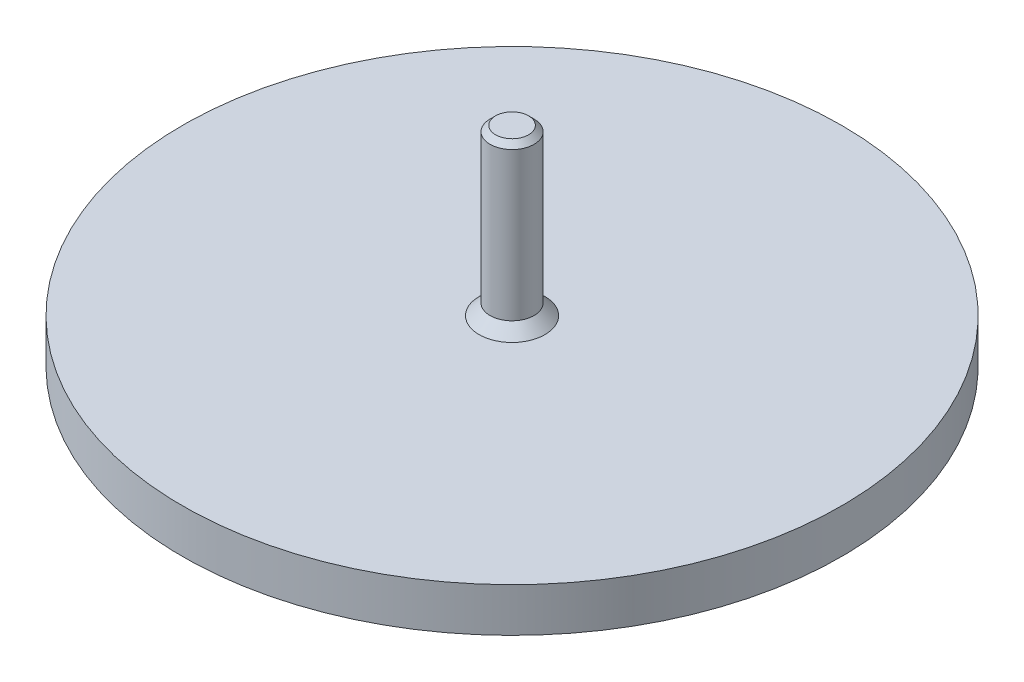
ISO-10303-21;
HEADER;
FILE_DESCRIPTION(('STEP AP214'),'2;1');
FILE_NAME('part.step','',(''),(''),'','','');
FILE_SCHEMA(('AUTOMOTIVE_DESIGN { 1 0 10303 214 1 1 1 1 }'));
ENDSEC;
DATA;
#1=APPLICATION_CONTEXT('core data for automotive mechanical design processes');
#2=APPLICATION_PROTOCOL_DEFINITION('international standard','automotive_design',2000,#1);
#3=PRODUCT_CONTEXT('',#1,'mechanical');
#4=PRODUCT('Part','Part','',(#3));
#5=PRODUCT_RELATED_PRODUCT_CATEGORY('part','',(#4));
#6=PRODUCT_DEFINITION_FORMATION('','',#4);
#7=PRODUCT_DEFINITION_CONTEXT('part definition',#1,'design');
#8=PRODUCT_DEFINITION('design','',#6,#7);
#9=PRODUCT_DEFINITION_SHAPE('','',#8);
#10=(LENGTH_UNIT() NAMED_UNIT(*) SI_UNIT(.MILLI.,.METRE.));
#11=(NAMED_UNIT(*) PLANE_ANGLE_UNIT() SI_UNIT($,.RADIAN.));
#12=(NAMED_UNIT(*) SI_UNIT($,.STERADIAN.) SOLID_ANGLE_UNIT());
#13=UNCERTAINTY_MEASURE_WITH_UNIT(LENGTH_MEASURE(1.E-05),#10,'distance_accuracy_value','');
#14=(GEOMETRIC_REPRESENTATION_CONTEXT(3) GLOBAL_UNCERTAINTY_ASSIGNED_CONTEXT((#13)) GLOBAL_UNIT_ASSIGNED_CONTEXT((#10,
#11,#12)) REPRESENTATION_CONTEXT('',''));
#15=CARTESIAN_POINT('',(0.,0.,0.));
#16=DIRECTION('',(0.,0.,1.));
#17=DIRECTION('',(1.,0.,0.));
#18=AXIS2_PLACEMENT_3D('',#15,#16,#17);
#19=CARTESIAN_POINT('',(0.,0.,0.));
#20=DIRECTION('',(0.,1.,0.));
#21=DIRECTION('',(0.,0.,1.));
#22=AXIS2_PLACEMENT_3D('',#19,#20,#21);
#23=PLANE('',#22);
#24=CARTESIAN_POINT('',(0.,0.,0.));
#25=DIRECTION('',(0.,-1.,0.));
#26=DIRECTION('',(0.,0.,-1.));
#27=AXIS2_PLACEMENT_3D('',#24,#25,#26);
#28=CIRCLE('',#27,30.);
#29=CARTESIAN_POINT('',(0.,0.,-30.));
#30=VERTEX_POINT('',#29);
#31=EDGE_CURVE('E51',#30,#30,#28,.T.);
#32=ORIENTED_EDGE('',*,*,#31,.T.);
#33=EDGE_LOOP('',(#32));
#34=FACE_BOUND('',#33,.T.);
#35=ADVANCED_FACE('F31',(#34),#23,.F.);
#36=CARTESIAN_POINT('',(0.,0.,0.));
#37=DIRECTION('',(0.,-1.,0.));
#38=DIRECTION('',(0.,0.,-1.));
#39=AXIS2_PLACEMENT_3D('',#36,#37,#38);
#40=CYLINDRICAL_SURFACE('',#39,30.);
#41=ORIENTED_EDGE('',*,*,#31,.F.);
#42=EDGE_LOOP('',(#41));
#43=FACE_BOUND('',#42,.T.);
#44=CARTESIAN_POINT('',(0.,4.,0.));
#45=DIRECTION('',(0.,-1.,0.));
#46=DIRECTION('',(0.,0.,-1.));
#47=AXIS2_PLACEMENT_3D('',#44,#45,#46);
#48=CIRCLE('',#47,30.);
#49=CARTESIAN_POINT('',(0.,4.,-30.));
#50=VERTEX_POINT('',#49);
#51=EDGE_CURVE('E54',#50,#50,#48,.T.);
#52=ORIENTED_EDGE('',*,*,#51,.T.);
#53=EDGE_LOOP('',(#52));
#54=FACE_BOUND('',#53,.T.);
#55=ADVANCED_FACE('F58',(#43,#54),#40,.T.);
#56=CARTESIAN_POINT('',(-30.,4.,0.));
#57=DIRECTION('',(0.,-1.,0.));
#58=DIRECTION('',(0.,0.,-1.));
#59=AXIS2_PLACEMENT_3D('',#56,#57,#58);
#60=PLANE('',#59);
#61=CARTESIAN_POINT('',(0.,4.,0.));
#62=DIRECTION('',(0.,-1.,0.));
#63=DIRECTION('',(0.,0.,-1.));
#64=AXIS2_PLACEMENT_3D('',#61,#62,#63);
#65=CIRCLE('',#64,2.99999999999998);
#66=CARTESIAN_POINT('',(0.,4.,-2.99999999999998));
#67=VERTEX_POINT('',#66);
#68=EDGE_CURVE('E46',#67,#67,#65,.T.);
#69=ORIENTED_EDGE('',*,*,#68,.T.);
#70=EDGE_LOOP('',(#69));
#71=FACE_BOUND('',#70,.T.);
#72=ORIENTED_EDGE('',*,*,#51,.F.);
#73=EDGE_LOOP('',(#72));
#74=FACE_BOUND('',#73,.T.);
#75=ADVANCED_FACE('F60',(#71,#74),#60,.F.);
#76=CARTESIAN_POINT('',(0.,0.,0.));
#77=DIRECTION('',(0.,-1.,0.));
#78=DIRECTION('',(0.,0.,-1.));
#79=AXIS2_PLACEMENT_3D('',#76,#77,#78);
#80=CYLINDRICAL_SURFACE('',#79,2.);
#81=CARTESIAN_POINT('',(0.,18.5,0.));
#82=DIRECTION('',(0.,-1.,0.));
#83=DIRECTION('',(0.,0.,-1.));
#84=AXIS2_PLACEMENT_3D('',#81,#82,#83);
#85=CIRCLE('',#84,2.);
#86=CARTESIAN_POINT('',(0.,18.5,-2.));
#87=VERTEX_POINT('',#86);
#88=EDGE_CURVE('E38',#87,#87,#85,.T.);
#89=ORIENTED_EDGE('',*,*,#88,.T.);
#90=EDGE_LOOP('',(#89));
#91=FACE_BOUND('',#90,.T.);
#92=CARTESIAN_POINT('',(0.,4.99999999999996,0.));
#93=DIRECTION('',(0.,-1.,0.));
#94=DIRECTION('',(0.,0.,-1.));
#95=AXIS2_PLACEMENT_3D('',#92,#93,#94);
#96=CIRCLE('',#95,2.);
#97=CARTESIAN_POINT('',(0.,4.99999999999996,-2.));
#98=VERTEX_POINT('',#97);
#99=EDGE_CURVE('E42',#98,#98,#96,.F.);
#100=ORIENTED_EDGE('',*,*,#99,.T.);
#101=EDGE_LOOP('',(#100));
#102=FACE_BOUND('',#101,.T.);
#103=ADVANCED_FACE('F62',(#91,#102),#80,.T.);
#104=CARTESIAN_POINT('',(-2.,19.,0.));
#105=DIRECTION('',(0.,-1.,0.));
#106=DIRECTION('',(0.,0.,-1.));
#107=AXIS2_PLACEMENT_3D('',#104,#105,#106);
#108=PLANE('',#107);
#109=CARTESIAN_POINT('',(0.,19.,0.));
#110=DIRECTION('',(0.,-1.,0.));
#111=DIRECTION('',(0.,0.,-1.));
#112=AXIS2_PLACEMENT_3D('',#109,#110,#111);
#113=CIRCLE('',#112,1.49999999999999);
#114=CARTESIAN_POINT('',(0.,19.,-1.49999999999999));
#115=VERTEX_POINT('',#114);
#116=EDGE_CURVE('E10',#115,#115,#113,.F.);
#117=ORIENTED_EDGE('',*,*,#116,.T.);
#118=EDGE_LOOP('',(#117));
#119=FACE_BOUND('',#118,.T.);
#120=ADVANCED_FACE('F69',(#119),#108,.F.);
#121=CARTESIAN_POINT('',(0.,4.,0.));
#122=DIRECTION('',(0.,-1.,0.));
#123=DIRECTION('',(0.,0.,-1.));
#124=AXIS2_PLACEMENT_3D('',#121,#122,#123);
#125=CONICAL_SURFACE('',#124,2.99999999999998,0.785398163397455);
#126=ORIENTED_EDGE('',*,*,#99,.F.);
#127=EDGE_LOOP('',(#126));
#128=FACE_BOUND('',#127,.T.);
#129=ORIENTED_EDGE('',*,*,#68,.F.);
#130=EDGE_LOOP('',(#129));
#131=FACE_BOUND('',#130,.T.);
#132=ADVANCED_FACE('F78',(#128,#131),#125,.T.);
#133=CARTESIAN_POINT('',(0.,18.5,0.));
#134=DIRECTION('',(0.,-1.,0.));
#135=DIRECTION('',(0.,0.,-1.));
#136=AXIS2_PLACEMENT_3D('',#133,#134,#135);
#137=CONICAL_SURFACE('',#136,2.,0.785398163397447);
#138=ORIENTED_EDGE('',*,*,#116,.F.);
#139=EDGE_LOOP('',(#138));
#140=FACE_BOUND('',#139,.T.);
#141=ORIENTED_EDGE('',*,*,#88,.F.);
#142=EDGE_LOOP('',(#141));
#143=FACE_BOUND('',#142,.T.);
#144=ADVANCED_FACE('F33',(#140,#143),#137,.T.);
#145=CLOSED_SHELL('',(#35,#55,#75,#103,#120,#132,#144));
#146=MANIFOLD_SOLID_BREP('B2',#145);
#147=ADVANCED_BREP_SHAPE_REPRESENTATION('',(#18,#146),#14);
#148=SHAPE_DEFINITION_REPRESENTATION(#9,#147);
ENDSEC;
END-ISO-10303-21;
